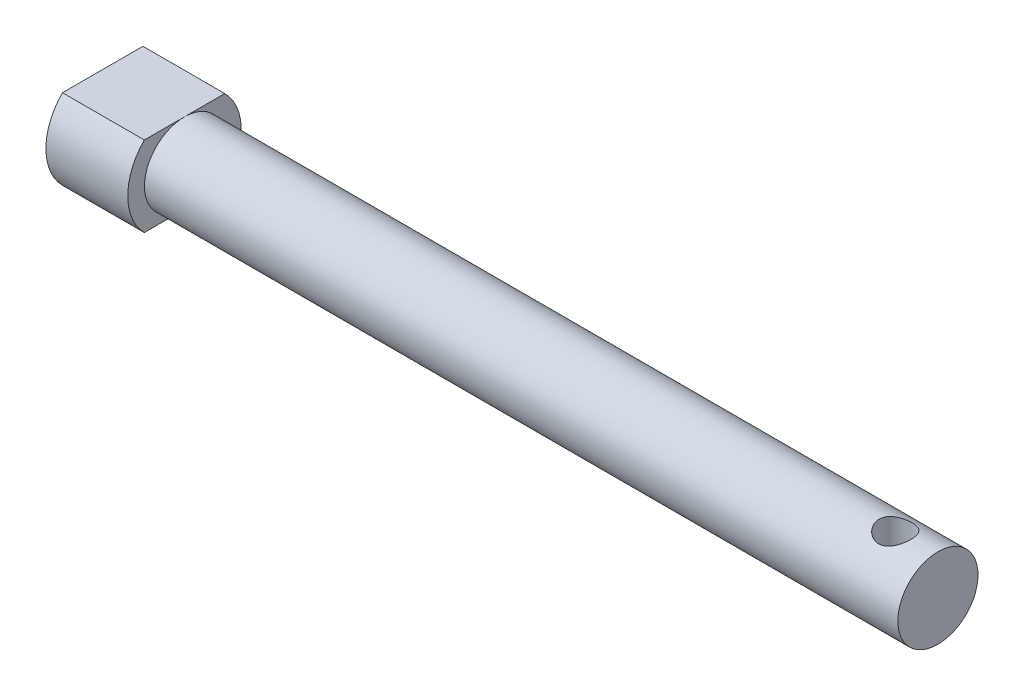
ISO-10303-21;
HEADER;
FILE_DESCRIPTION(('STEP AP214'),'2;1');
FILE_NAME('part.step','',(''),(''),'','','');
FILE_SCHEMA(('AUTOMOTIVE_DESIGN { 1 0 10303 214 1 1 1 1 }'));
ENDSEC;
DATA;
#1=APPLICATION_CONTEXT('core data for automotive mechanical design processes');
#2=APPLICATION_PROTOCOL_DEFINITION('international standard','automotive_design',2000,#1);
#3=PRODUCT_CONTEXT('',#1,'mechanical');
#4=PRODUCT('Part','Part','',(#3));
#5=PRODUCT_RELATED_PRODUCT_CATEGORY('part','',(#4));
#6=PRODUCT_DEFINITION_FORMATION('','',#4);
#7=PRODUCT_DEFINITION_CONTEXT('part definition',#1,'design');
#8=PRODUCT_DEFINITION('design','',#6,#7);
#9=PRODUCT_DEFINITION_SHAPE('','',#8);
#10=(LENGTH_UNIT() NAMED_UNIT(*) SI_UNIT(.MILLI.,.METRE.));
#11=(NAMED_UNIT(*) PLANE_ANGLE_UNIT() SI_UNIT($,.RADIAN.));
#12=(NAMED_UNIT(*) SI_UNIT($,.STERADIAN.) SOLID_ANGLE_UNIT());
#13=UNCERTAINTY_MEASURE_WITH_UNIT(LENGTH_MEASURE(1.E-05),#10,'distance_accuracy_value','');
#14=(GEOMETRIC_REPRESENTATION_CONTEXT(3) GLOBAL_UNCERTAINTY_ASSIGNED_CONTEXT((#13)) GLOBAL_UNIT_ASSIGNED_CONTEXT((#10,
#11,#12)) REPRESENTATION_CONTEXT('',''));
#15=CARTESIAN_POINT('',(0.,0.,0.));
#16=DIRECTION('',(0.,0.,1.));
#17=DIRECTION('',(1.,0.,0.));
#18=AXIS2_PLACEMENT_3D('',#15,#16,#17);
#19=CARTESIAN_POINT('',(25.,0.,0.));
#20=DIRECTION('',(-1.,0.,0.));
#21=DIRECTION('',(0.,0.,1.));
#22=AXIS2_PLACEMENT_3D('',#19,#20,#21);
#23=CYLINDRICAL_SURFACE('',#22,2.4);
#24=CARTESIAN_POINT('',(22.55,2.13307290077015,1.1));
#25=CARTESIAN_POINT('',(22.4973611081542,2.13307906742956,1.0999939328162));
#26=CARTESIAN_POINT('',(22.4446327975776,2.13524724251786,1.09581537649799));
#27=CARTESIAN_POINT('',(22.3407239597943,2.14365008243596,1.07927948296696));
#28=CARTESIAN_POINT('',(22.2895481672871,2.14989608897144,1.06689933317801));
#29=CARTESIAN_POINT('',(22.1904582159836,2.16563423361136,1.03457587900994));
#30=CARTESIAN_POINT('',(22.1425300037906,2.17511115003898,1.01466799265654));
#31=CARTESIAN_POINT('',(22.0507295581409,2.1962868401096,0.967976609276169));
#32=CARTESIAN_POINT('',(22.0068564321033,2.20798512305905,0.941194630258112));
#33=CARTESIAN_POINT('',(21.9211222849345,2.23334152629688,0.879415715364733));
#34=CARTESIAN_POINT('',(21.8795957451861,2.24707857585225,0.843987011030266));
#35=CARTESIAN_POINT('',(21.8028235517017,2.27455826200032,0.766851375117863));
#36=CARTESIAN_POINT('',(21.767580957401,2.28830089806722,0.725141403538048));
#37=CARTESIAN_POINT('',(21.70220125569,2.31541047009048,0.633479084620091));
#38=CARTESIAN_POINT('',(21.6725236507046,2.32869963830472,0.58317364924949));
#39=CARTESIAN_POINT('',(21.6222068512608,2.35261129562496,0.477641105787621));
#40=CARTESIAN_POINT('',(21.6015641774462,2.36323481060152,0.422415902179575));
#41=CARTESIAN_POINT('',(21.5709747671704,2.38035043240875,0.311346063643463));
#42=CARTESIAN_POINT('',(21.5605656093708,2.38701514754088,0.255656085177394));
#43=CARTESIAN_POINT('',(21.549324856314,2.39640138483369,0.142999510461193));
#44=CARTESIAN_POINT('',(21.5484882857825,2.39912495472945,0.0860335927979068));
#45=CARTESIAN_POINT('',(21.5562113671414,2.40046442294417,-0.0231216409185724));
#46=CARTESIAN_POINT('',(21.5640921844718,2.39936461444224,-0.0753570775239067));
#47=CARTESIAN_POINT('',(21.5879164380917,2.39395611770608,-0.177776008278701));
#48=CARTESIAN_POINT('',(21.6038599809259,2.38964738706726,-0.227959475302976));
#49=CARTESIAN_POINT('',(21.6432695754514,2.37840171681631,-0.324948964868288));
#50=CARTESIAN_POINT('',(21.6667359345588,2.37146466979723,-0.371754849290331));
#51=CARTESIAN_POINT('',(21.7204966789125,2.35575905046772,-0.460925101526949));
#52=CARTESIAN_POINT('',(21.7507931029417,2.34698993133886,-0.503288137602053));
#53=CARTESIAN_POINT('',(21.8195443902385,2.32796993020943,-0.585177238951835));
#54=CARTESIAN_POINT('',(21.8583900632552,2.31766075850173,-0.624361900304632));
#55=CARTESIAN_POINT('',(21.9420202339738,2.2972088064946,-0.695857361994229));
#56=CARTESIAN_POINT('',(21.9868068445226,2.28706608684134,-0.728165706127452));
#57=CARTESIAN_POINT('',(22.0831056763412,2.26780044352582,-0.786163316608232));
#58=CARTESIAN_POINT('',(22.1348081956902,2.25873059413291,-0.811556047657341));
#59=CARTESIAN_POINT('',(22.2421593016957,2.24334322193062,-0.853175569499846));
#60=CARTESIAN_POINT('',(22.2978058813868,2.23702431081224,-0.869406984940142));
#61=CARTESIAN_POINT('',(22.408682702335,2.22830957814681,-0.89150000726717));
#62=CARTESIAN_POINT('',(22.4638089749778,2.22574290655263,-0.897814264530672));
#63=CARTESIAN_POINT('',(22.5743849701251,2.22436247380749,-0.901230510564537));
#64=CARTESIAN_POINT('',(22.6298345882284,2.22554756173807,-0.898335324492917));
#65=CARTESIAN_POINT('',(22.7363489739482,2.23132687093266,-0.883874240941882));
#66=CARTESIAN_POINT('',(22.7874894540144,2.23573493299733,-0.872781474695769));
#67=CARTESIAN_POINT('',(22.887152282497,2.24717490771103,-0.842887305451859));
#68=CARTESIAN_POINT('',(22.9356740778623,2.25420737215596,-0.824084281245122));
#69=CARTESIAN_POINT('',(23.0305469517725,2.27032677761784,-0.778598215514448));
#70=CARTESIAN_POINT('',(23.0767708827,2.27947464412103,-0.751672325609347));
#71=CARTESIAN_POINT('',(23.164243316562,2.29861966860239,-0.690913014195771));
#72=CARTESIAN_POINT('',(23.2054899328908,2.30861714618615,-0.657076986464709));
#73=CARTESIAN_POINT('',(23.2845917759763,2.32900067905208,-0.580867510205292));
#74=CARTESIAN_POINT('',(23.3220587175092,2.33937041788318,-0.538085151876284));
#75=CARTESIAN_POINT('',(23.3893452347941,2.35855248535297,-0.446557115893864));
#76=CARTESIAN_POINT('',(23.4191650626518,2.3673648653308,-0.397811634907576));
#77=CARTESIAN_POINT('',(23.4699906110515,2.38222541231385,-0.296012851056268));
#78=CARTESIAN_POINT('',(23.4910650838091,2.38829517554384,-0.242997220710753));
#79=CARTESIAN_POINT('',(23.5239270606385,2.39688527708697,-0.133895395866685));
#80=CARTESIAN_POINT('',(23.5357196100443,2.39940754428439,-0.0778108872618394));
#81=CARTESIAN_POINT('',(23.549104143054,2.40037396052816,0.0318670955152565));
#82=CARTESIAN_POINT('',(23.5513123558277,2.39907383589794,0.0853838521203222));
#83=CARTESIAN_POINT('',(23.547194889212,2.39291197651022,0.191874103386284));
#84=CARTESIAN_POINT('',(23.5408700285691,2.38805058347601,0.244847649676699));
#85=CARTESIAN_POINT('',(23.5202525169446,2.3752497838713,0.347580223332054));
#86=CARTESIAN_POINT('',(23.5061387331075,2.3673806519249,0.397384385846545));
#87=CARTESIAN_POINT('',(23.4706198530052,2.34915802283027,0.4938299154724));
#88=CARTESIAN_POINT('',(23.4492130843792,2.33880395602051,0.540470554209221));
#89=CARTESIAN_POINT('',(23.3983526585985,2.31575614642506,0.632166283652874));
#90=CARTESIAN_POINT('',(23.3685108603735,2.30296288550046,0.676980668214599));
#91=CARTESIAN_POINT('',(23.302188029797,2.27654067293713,0.761124738666118));
#92=CARTESIAN_POINT('',(23.265704050125,2.26291135210265,0.800451976017577));
#93=CARTESIAN_POINT('',(23.1840132129683,2.23501818022079,0.875447087089281));
#94=CARTESIAN_POINT('',(23.1383677985527,2.22077916089791,0.910648572977793));
#95=CARTESIAN_POINT('',(23.0412661917743,2.19421615670551,0.972916229820275));
#96=CARTESIAN_POINT('',(22.9898070978567,2.18189313544867,0.999978313577709));
#97=CARTESIAN_POINT('',(22.883230424813,2.16088948174157,1.04458501148177));
#98=CARTESIAN_POINT('',(22.8281865569538,2.15215250626611,1.06227822630659));
#99=CARTESIAN_POINT('',(22.71546584836,2.13932255971477,1.08789425144292));
#100=CARTESIAN_POINT('',(22.6577993556071,2.13521274791839,1.09585250170122));
#101=CARTESIAN_POINT('',(22.5833000030658,2.13328542286212,1.0995861591471));
#102=CARTESIAN_POINT('',(22.5666544770893,2.13307094969398,1.10000191960298));
#103=CARTESIAN_POINT('',(22.55,2.13307290077015,1.1));
#104=B_SPLINE_CURVE_WITH_KNOTS('',3,(#24,#25,#26,#27,#28,#29,#30,#31,#32,#33,#34,#35,#36,#37,
#38,#39,#40,#41,#42,#43,#44,#45,#46,#47,#48,#49,#50,#51,#52,#53,#54,#55,#56,#57,#58,#59,#60,#61,
#62,#63,#64,#65,#66,#67,#68,#69,#70,#71,#72,#73,#74,#75,#76,#77,#78,#79,#80,#81,#82,#83,#84,#85,
#86,#87,#88,#89,#90,#91,#92,#93,#94,#95,#96,#97,#98,#99,#100,#101,#102,#103),.UNSPECIFIED.,.T.,
.F.,(4,2,2,2,2,2,2,2,2,2,2,2,2,2,2,2,2,2,2,2,2,2,2,2,2,2,2,2,2,2,2,2,2,2,2,2,2,2,2,4),(0.,
0.157869104510436,0.316179172996984,0.473753477652681,0.631293014999153,0.799441977680217,
0.967672584047119,1.14646607267386,1.32519064713431,1.49540657942962,1.6655340393593,
1.82329046845569,1.98104898227579,2.13881394364032,2.29662606054454,2.46427448835348,
2.63198269963741,2.80603344041099,2.97999624132839,3.14576066508831,3.31147424261297,
3.46830440352326,3.62516755748549,3.78728490431094,3.94946350849404,4.12206432385825,
4.29465944828485,4.46587075117827,4.63698892510723,4.79692484805356,4.95684542627888,
5.11323777382421,5.26966600800328,5.43498329920153,5.60037412586418,5.77765607544761,
5.95502689901022,6.12949309948273,6.30332225062417,6.35327063084235),.UNSPECIFIED.);
#105=CARTESIAN_POINT('',(22.55,2.13307290077015,1.1));
#106=VERTEX_POINT('',#105);
#107=EDGE_CURVE('E41',#106,#106,#104,.T.);
#108=ORIENTED_EDGE('',*,*,#107,.T.);
#109=EDGE_LOOP('',(#108));
#110=FACE_BOUND('',#109,.T.);
#111=CARTESIAN_POINT('',(21.5550125628934,-2.4,0.));
#112=CARTESIAN_POINT('',(21.5496974800274,-2.39999569804389,0.0529425259667533));
#113=CARTESIAN_POINT('',(21.5486128021127,-2.39822816233619,0.106390009477298));
#114=CARTESIAN_POINT('',(21.5549316438037,-2.39115881388499,0.212627950102524));
#115=CARTESIAN_POINT('',(21.562356044126,-2.3858483203446,0.265416468227451));
#116=CARTESIAN_POINT('',(21.5853038440982,-2.3720951767978,0.368597497843321));
#117=CARTESIAN_POINT('',(21.600802292909,-2.36366219914388,0.418996871856474));
#118=CARTESIAN_POINT('',(21.6392714286819,-2.34433138032263,0.516308668360662));
#119=CARTESIAN_POINT('',(21.6622399527948,-2.33343425289117,0.563222095331718));
#120=CARTESIAN_POINT('',(21.7160904886893,-2.30952131854956,0.654549466685829));
#121=CARTESIAN_POINT('',(21.7472710226083,-2.29643441583934,0.698768407047663));
#122=CARTESIAN_POINT('',(21.8162253508586,-2.26960601199557,0.7815271091903));
#123=CARTESIAN_POINT('',(21.8540031400232,-2.25586411793219,0.820063403733166));
#124=CARTESIAN_POINT('',(21.93820360084,-2.22800111348079,0.893108947720343));
#125=CARTESIAN_POINT('',(21.9850437763653,-2.21391964761464,0.927154489497616));
#126=CARTESIAN_POINT('',(22.0843583970891,-2.18795761834367,0.986866549171384));
#127=CARTESIAN_POINT('',(22.1368317412667,-2.17607662608198,1.01253470050727));
#128=CARTESIAN_POINT('',(22.2445869115371,-2.15633329209444,1.05391744485951));
#129=CARTESIAN_POINT('',(22.2997506133969,-2.14836871052155,1.0698881565395));
#130=CARTESIAN_POINT('',(22.4124412490498,-2.13713927860724,1.09215283782124));
#131=CARTESIAN_POINT('',(22.4699657062601,-2.13386962638131,1.09845669494732));
#132=CARTESIAN_POINT('',(22.5792924355966,-2.13260372429351,1.10090824065433));
#133=CARTESIAN_POINT('',(22.6310694113897,-2.13409571923493,1.09804145780892));
#134=CARTESIAN_POINT('',(22.7332951012732,-2.14105436610606,1.08440940019957));
#135=CARTESIAN_POINT('',(22.7837436932753,-2.14652138205765,1.07364340204561));
#136=CARTESIAN_POINT('',(22.8810300973231,-2.16062712990782,1.04495800731632));
#137=CARTESIAN_POINT('',(22.927917587299,-2.16920503367838,1.02717526063003));
#138=CARTESIAN_POINT('',(23.0181333635436,-2.18865085860167,0.985060317307436));
#139=CARTESIAN_POINT('',(23.0614604701014,-2.19951953456909,0.960725961165837));
#140=CARTESIAN_POINT('',(23.1476644564978,-2.22364989181094,0.903564653594588));
#141=CARTESIAN_POINT('',(23.1901196901317,-2.23704033491013,0.870156025311646));
#142=CARTESIAN_POINT('',(23.269081376733,-2.26413302659586,0.797008744577358));
#143=CARTESIAN_POINT('',(23.3055847747464,-2.27783543121953,0.757266861961596));
#144=CARTESIAN_POINT('',(23.3742808767427,-2.30533084943626,0.669126102203923));
#145=CARTESIAN_POINT('',(23.4059644650497,-2.31905747551664,0.620307076082446));
#146=CARTESIAN_POINT('',(23.4605700674532,-2.34415476231149,0.517432625147293));
#147=CARTESIAN_POINT('',(23.4834945510773,-2.35552608666126,0.463378681652977));
#148=CARTESIAN_POINT('',(23.5189833780136,-2.37444818230659,0.35353486437855));
#149=CARTESIAN_POINT('',(23.531891889784,-2.38212207109484,0.297878129052698));
#150=CARTESIAN_POINT('',(23.5480314073336,-2.39354827605952,0.184794371954068));
#151=CARTESIAN_POINT('',(23.5512679761894,-2.39730284572813,0.127368387024957));
#152=CARTESIAN_POINT('',(23.5479655544935,-2.40052459277589,0.0170969889341838));
#153=CARTESIAN_POINT('',(23.5421553835185,-2.40029775517561,-0.0357627982431015));
#154=CARTESIAN_POINT('',(23.5222714469845,-2.39649149816038,-0.139773122328005));
#155=CARTESIAN_POINT('',(23.5081979689085,-2.39291219537622,-0.190923718633496));
#156=CARTESIAN_POINT('',(23.472474525128,-2.38297791160866,-0.28956967274061));
#157=CARTESIAN_POINT('',(23.4509080826971,-2.37665334559645,-0.337098558928608));
#158=CARTESIAN_POINT('',(23.4008302403677,-2.36197790019458,-0.427998766973065));
#159=CARTESIAN_POINT('',(23.3723170219734,-2.35362649022907,-0.471368996045478));
#160=CARTESIAN_POINT('',(23.3072254652978,-2.33526187793159,-0.555437694180424));
#161=CARTESIAN_POINT('',(23.2702728817212,-2.32518003916652,-0.595831416710561));
#162=CARTESIAN_POINT('',(23.1902963439072,-2.30488551760114,-0.67006468590944));
#163=CARTESIAN_POINT('',(23.1472699510679,-2.29467278375192,-0.703901587038819));
#164=CARTESIAN_POINT('',(23.053991829791,-2.27485383065271,-0.765597944701423));
#165=CARTESIAN_POINT('',(23.0034984429212,-2.26529728095782,-0.793109900972709));
#166=CARTESIAN_POINT('',(22.8982028161419,-2.24864109308228,-0.839176947154155));
#167=CARTESIAN_POINT('',(22.8434023404268,-2.24154045532408,-0.857735682320428));
#168=CARTESIAN_POINT('',(22.7332158936787,-2.23105523207025,-0.884644281150268));
#169=CARTESIAN_POINT('',(22.6779308166716,-2.22754001580007,-0.893354380436047));
#170=CARTESIAN_POINT('',(22.5665817012624,-2.22429025323019,-0.901417820672914));
#171=CARTESIAN_POINT('',(22.5105179851024,-2.22455418690983,-0.900774923512732));
#172=CARTESIAN_POINT('',(22.4027842395513,-2.2286866172735,-0.890494726525893));
#173=CARTESIAN_POINT('',(22.3510526079754,-2.23233759513042,-0.881400140959037));
#174=CARTESIAN_POINT('',(22.2499031056937,-2.24245183882901,-0.855338044945117));
#175=CARTESIAN_POINT('',(22.2004856845957,-2.24891564866143,-0.838369011568367));
#176=CARTESIAN_POINT('',(22.104067767797,-2.2640366428719,-0.796642223211279));
#177=CARTESIAN_POINT('',(22.057147637869,-2.27274030130489,-0.771716352113727));
#178=CARTESIAN_POINT('',(21.9679799208291,-2.29124855524274,-0.714892445402546));
#179=CARTESIAN_POINT('',(21.9257335880264,-2.30105344486972,-0.682992544968111));
#180=CARTESIAN_POINT('',(21.8441490442164,-2.32135285560915,-0.610593787152216));
#181=CARTESIAN_POINT('',(21.8051937379878,-2.33184968297854,-0.569662799067172));
#182=CARTESIAN_POINT('',(21.7345779913033,-2.35161292864844,-0.48161164820141));
#183=CARTESIAN_POINT('',(21.7029220920254,-2.36087857948688,-0.434487661035162));
#184=CARTESIAN_POINT('',(21.6477786736254,-2.37703787501423,-0.335023691084191));
#185=CARTESIAN_POINT('',(21.624327335056,-2.38392101188822,-0.282661882483391));
#186=CARTESIAN_POINT('',(21.5867181158545,-2.39425968288849,-0.174491685489168));
#187=CARTESIAN_POINT('',(21.5725315257272,-2.39772582274163,-0.118694536291066));
#188=CARTESIAN_POINT('',(21.5598414638591,-2.39973126242434,-0.0415186885305491));
#189=CARTESIAN_POINT('',(21.5571005768997,-2.40000169001026,-0.0207983089892846));
#190=CARTESIAN_POINT('',(21.5550125628934,-2.4,0.));
#191=B_SPLINE_CURVE_WITH_KNOTS('',3,(#111,#112,#113,#114,#115,#116,#117,#118,#119,#120,#121,
#122,#123,#124,#125,#126,#127,#128,#129,#130,#131,#132,#133,#134,#135,#136,#137,#138,#139,#140,
#141,#142,#143,#144,#145,#146,#147,#148,#149,#150,#151,#152,#153,#154,#155,#156,#157,#158,#159,
#160,#161,#162,#163,#164,#165,#166,#167,#168,#169,#170,#171,#172,#173,#174,#175,#176,#177,#178,
#179,#180,#181,#182,#183,#184,#185,#186,#187,#188,#189,#190),.UNSPECIFIED.,.T.,.F.,(4,2,2,2,2,2,
2,2,2,2,2,2,2,2,2,2,2,2,2,2,2,2,2,2,2,2,2,2,2,2,2,2,2,2,2,2,2,2,2,4),(0.,0.159564863902349,
0.31952212936855,0.478987993391657,0.638407727486984,0.804701606014101,0.971096531790586,
1.14901486740354,1.32689849140983,1.49985265365396,1.67262979535882,1.82748753367316,
1.98235945523518,2.13435338189861,2.28639746942571,2.45267142602693,2.61903046075068,
2.79753212428725,2.97598342415412,3.14799175449839,3.31990113059213,3.47866072697354,
3.63741480038462,3.79445320819497,3.95153276906509,4.11780198725526,4.28413815252278,
4.45814295522003,4.63207685287653,4.79941910348179,4.96669404886358,5.12391893220525,
5.28117423574963,5.44200049193113,5.60286980496759,5.77448761382251,5.94621190487067,
6.11868419492535,6.2906194614209,6.35330402893395),.UNSPECIFIED.);
#192=CARTESIAN_POINT('',(21.5550125628934,-2.4,0.));
#193=VERTEX_POINT('',#192);
#194=EDGE_CURVE('E11',#193,#193,#191,.T.);
#195=ORIENTED_EDGE('',*,*,#194,.T.);
#196=EDGE_LOOP('',(#195));
#197=FACE_BOUND('',#196,.T.);
#198=CARTESIAN_POINT('',(25.,0.,0.));
#199=DIRECTION('',(1.,0.,0.));
#200=DIRECTION('',(0.,0.,-1.));
#201=AXIS2_PLACEMENT_3D('',#198,#199,#200);
#202=CIRCLE('',#201,2.4);
#203=CARTESIAN_POINT('',(25.,0.,-2.4));
#204=VERTEX_POINT('',#203);
#205=EDGE_CURVE('E51',#204,#204,#202,.T.);
#206=ORIENTED_EDGE('',*,*,#205,.F.);
#207=EDGE_LOOP('',(#206));
#208=FACE_BOUND('',#207,.T.);
#209=CARTESIAN_POINT('',(-20.1,0.,0.));
#210=DIRECTION('',(-1.,0.,0.));
#211=DIRECTION('',(0.,0.,1.));
#212=AXIS2_PLACEMENT_3D('',#209,#210,#211);
#213=CIRCLE('',#212,2.4);
#214=CARTESIAN_POINT('',(-20.1,2.4,0.));
#215=VERTEX_POINT('',#214);
#216=CARTESIAN_POINT('',(-20.1,-2.4,0.));
#217=VERTEX_POINT('',#216);
#218=EDGE_CURVE('E80',#215,#217,#213,.T.);
#219=ORIENTED_EDGE('',*,*,#218,.F.);
#220=CARTESIAN_POINT('',(-20.1,0.,0.));
#221=DIRECTION('',(-1.,0.,0.));
#222=DIRECTION('',(0.,0.,1.));
#223=AXIS2_PLACEMENT_3D('',#220,#221,#222);
#224=CIRCLE('',#223,2.4);
#225=EDGE_CURVE('E125',#217,#215,#224,.T.);
#226=ORIENTED_EDGE('',*,*,#225,.F.);
#227=EDGE_LOOP('',(#219,#226));
#228=FACE_BOUND('',#227,.T.);
#229=ADVANCED_FACE('F37',(#110,#197,#208,#228),#23,.T.);
#230=CARTESIAN_POINT('',(25.,0.,0.));
#231=DIRECTION('',(1.,0.,0.));
#232=DIRECTION('',(0.,0.,-1.));
#233=AXIS2_PLACEMENT_3D('',#230,#231,#232);
#234=PLANE('',#233);
#235=ORIENTED_EDGE('',*,*,#205,.T.);
#236=EDGE_LOOP('',(#235));
#237=FACE_BOUND('',#236,.T.);
#238=ADVANCED_FACE('F164',(#237),#234,.T.);
#239=CARTESIAN_POINT('',(-25.,0.,0.));
#240=DIRECTION('',(1.,0.,0.));
#241=DIRECTION('',(0.,0.,-1.));
#242=AXIS2_PLACEMENT_3D('',#239,#240,#241);
#243=PLANE('',#242);
#244=DIRECTION('',(0.,0.,1.));
#245=VECTOR('',#244,1.);
#246=CARTESIAN_POINT('',(-25.,2.4,0.));
#247=LINE('',#246,#245);
#248=CARTESIAN_POINT('',(-25.,2.4,-2.40831891575846));
#249=VERTEX_POINT('',#248);
#250=CARTESIAN_POINT('',(-25.,2.4,2.40831891575846));
#251=VERTEX_POINT('',#250);
#252=EDGE_CURVE('E121',#249,#251,#247,.T.);
#253=ORIENTED_EDGE('',*,*,#252,.F.);
#254=CARTESIAN_POINT('',(-25.,0.,0.));
#255=DIRECTION('',(-1.,0.,0.));
#256=DIRECTION('',(0.,0.,1.));
#257=AXIS2_PLACEMENT_3D('',#254,#255,#256);
#258=CIRCLE('',#257,3.4);
#259=CARTESIAN_POINT('',(-25.,-2.4,-2.40831891575846));
#260=VERTEX_POINT('',#259);
#261=EDGE_CURVE('E103',#249,#260,#258,.T.);
#262=ORIENTED_EDGE('',*,*,#261,.T.);
#263=DIRECTION('',(0.,0.,1.));
#264=VECTOR('',#263,1.);
#265=CARTESIAN_POINT('',(-25.,-2.4,0.));
#266=LINE('',#265,#264);
#267=CARTESIAN_POINT('',(-25.,-2.4,2.40831891575846));
#268=VERTEX_POINT('',#267);
#269=EDGE_CURVE('E127',#260,#268,#266,.T.);
#270=ORIENTED_EDGE('',*,*,#269,.T.);
#271=CARTESIAN_POINT('',(-25.,0.,0.));
#272=DIRECTION('',(-1.,0.,0.));
#273=DIRECTION('',(0.,0.,1.));
#274=AXIS2_PLACEMENT_3D('',#271,#272,#273);
#275=CIRCLE('',#274,3.4);
#276=EDGE_CURVE('E130',#268,#251,#275,.T.);
#277=ORIENTED_EDGE('',*,*,#276,.T.);
#278=EDGE_LOOP('',(#253,#262,#270,#277));
#279=FACE_BOUND('',#278,.T.);
#280=ADVANCED_FACE('F163',(#279),#243,.F.);
#281=CARTESIAN_POINT('',(-20.1,-2.4,0.));
#282=DIRECTION('',(0.,-1.,0.));
#283=DIRECTION('',(0.,0.,-1.));
#284=AXIS2_PLACEMENT_3D('',#281,#282,#283);
#285=PLANE('',#284);
#286=ORIENTED_EDGE('',*,*,#269,.F.);
#287=DIRECTION('',(-1.,0.,0.));
#288=VECTOR('',#287,1.);
#289=CARTESIAN_POINT('',(-20.1,-2.4,-2.40831891575846));
#290=LINE('',#289,#288);
#291=CARTESIAN_POINT('',(-20.1,-2.4,-2.40831891575846));
#292=VERTEX_POINT('',#291);
#293=EDGE_CURVE('E110',#292,#260,#290,.T.);
#294=ORIENTED_EDGE('',*,*,#293,.F.);
#295=DIRECTION('',(0.,0.,1.));
#296=VECTOR('',#295,1.);
#297=CARTESIAN_POINT('',(-20.1,-2.4,0.));
#298=LINE('',#297,#296);
#299=EDGE_CURVE('E106',#292,#217,#298,.T.);
#300=ORIENTED_EDGE('',*,*,#299,.T.);
#301=DIRECTION('',(0.,0.,1.));
#302=VECTOR('',#301,1.);
#303=CARTESIAN_POINT('',(-20.1,-2.4,0.));
#304=LINE('',#303,#302);
#305=CARTESIAN_POINT('',(-20.1,-2.4,2.40831891575846));
#306=VERTEX_POINT('',#305);
#307=EDGE_CURVE('E118',#217,#306,#304,.T.);
#308=ORIENTED_EDGE('',*,*,#307,.T.);
#309=DIRECTION('',(-1.,0.,0.));
#310=VECTOR('',#309,1.);
#311=CARTESIAN_POINT('',(-20.1,-2.4,2.40831891575846));
#312=LINE('',#311,#310);
#313=EDGE_CURVE('E70',#306,#268,#312,.T.);
#314=ORIENTED_EDGE('',*,*,#313,.T.);
#315=EDGE_LOOP('',(#286,#294,#300,#308,#314));
#316=FACE_BOUND('',#315,.T.);
#317=ADVANCED_FACE('F157',(#316),#285,.T.);
#318=CARTESIAN_POINT('',(-20.1,2.4,0.));
#319=DIRECTION('',(0.,-1.,0.));
#320=DIRECTION('',(0.,0.,-1.));
#321=AXIS2_PLACEMENT_3D('',#318,#319,#320);
#322=PLANE('',#321);
#323=ORIENTED_EDGE('',*,*,#252,.T.);
#324=DIRECTION('',(-1.,0.,0.));
#325=VECTOR('',#324,1.);
#326=CARTESIAN_POINT('',(-20.1,2.4,2.40831891575846));
#327=LINE('',#326,#325);
#328=CARTESIAN_POINT('',(-20.1,2.4,2.40831891575846));
#329=VERTEX_POINT('',#328);
#330=EDGE_CURVE('E134',#329,#251,#327,.T.);
#331=ORIENTED_EDGE('',*,*,#330,.F.);
#332=DIRECTION('',(0.,0.,1.));
#333=VECTOR('',#332,1.);
#334=CARTESIAN_POINT('',(-20.1,2.4,0.));
#335=LINE('',#334,#333);
#336=EDGE_CURVE('E59',#215,#329,#335,.T.);
#337=ORIENTED_EDGE('',*,*,#336,.F.);
#338=DIRECTION('',(0.,0.,1.));
#339=VECTOR('',#338,1.);
#340=CARTESIAN_POINT('',(-20.1,2.4,0.));
#341=LINE('',#340,#339);
#342=CARTESIAN_POINT('',(-20.1,2.4,-2.40831891575846));
#343=VERTEX_POINT('',#342);
#344=EDGE_CURVE('E108',#343,#215,#341,.T.);
#345=ORIENTED_EDGE('',*,*,#344,.F.);
#346=DIRECTION('',(-1.,0.,0.));
#347=VECTOR('',#346,1.);
#348=CARTESIAN_POINT('',(-20.1,2.4,-2.40831891575846));
#349=LINE('',#348,#347);
#350=EDGE_CURVE('E95',#343,#249,#349,.T.);
#351=ORIENTED_EDGE('',*,*,#350,.T.);
#352=EDGE_LOOP('',(#323,#331,#337,#345,#351));
#353=FACE_BOUND('',#352,.T.);
#354=ADVANCED_FACE('F109',(#353),#322,.F.);
#355=CARTESIAN_POINT('',(-20.1,0.,0.));
#356=DIRECTION('',(-1.,0.,0.));
#357=DIRECTION('',(0.,0.,1.));
#358=AXIS2_PLACEMENT_3D('',#355,#356,#357);
#359=CYLINDRICAL_SURFACE('',#358,3.4);
#360=ORIENTED_EDGE('',*,*,#276,.F.);
#361=ORIENTED_EDGE('',*,*,#313,.F.);
#362=CARTESIAN_POINT('',(-20.1,0.,0.));
#363=DIRECTION('',(-1.,0.,0.));
#364=DIRECTION('',(0.,0.,1.));
#365=AXIS2_PLACEMENT_3D('',#362,#363,#364);
#366=CIRCLE('',#365,3.4);
#367=EDGE_CURVE('E120',#306,#329,#366,.T.);
#368=ORIENTED_EDGE('',*,*,#367,.T.);
#369=ORIENTED_EDGE('',*,*,#330,.T.);
#370=EDGE_LOOP('',(#360,#361,#368,#369));
#371=FACE_BOUND('',#370,.T.);
#372=ADVANCED_FACE('F154',(#371),#359,.T.);
#373=CARTESIAN_POINT('',(-20.1,0.,0.));
#374=DIRECTION('',(-1.,0.,0.));
#375=DIRECTION('',(0.,0.,1.));
#376=AXIS2_PLACEMENT_3D('',#373,#374,#375);
#377=PLANE('',#376);
#378=ORIENTED_EDGE('',*,*,#307,.F.);
#379=ORIENTED_EDGE('',*,*,#225,.T.);
#380=ORIENTED_EDGE('',*,*,#336,.T.);
#381=ORIENTED_EDGE('',*,*,#367,.F.);
#382=EDGE_LOOP('',(#378,#379,#380,#381));
#383=FACE_BOUND('',#382,.T.);
#384=ADVANCED_FACE('F149',(#383),#377,.F.);
#385=CARTESIAN_POINT('',(-20.1,0.,0.));
#386=DIRECTION('',(-1.,0.,0.));
#387=DIRECTION('',(0.,0.,1.));
#388=AXIS2_PLACEMENT_3D('',#385,#386,#387);
#389=CYLINDRICAL_SURFACE('',#388,3.4);
#390=ORIENTED_EDGE('',*,*,#261,.F.);
#391=ORIENTED_EDGE('',*,*,#350,.F.);
#392=CARTESIAN_POINT('',(-20.1,0.,0.));
#393=DIRECTION('',(-1.,0.,0.));
#394=DIRECTION('',(0.,0.,1.));
#395=AXIS2_PLACEMENT_3D('',#392,#393,#394);
#396=CIRCLE('',#395,3.4);
#397=EDGE_CURVE('E100',#343,#292,#396,.T.);
#398=ORIENTED_EDGE('',*,*,#397,.T.);
#399=ORIENTED_EDGE('',*,*,#293,.T.);
#400=EDGE_LOOP('',(#390,#391,#398,#399));
#401=FACE_BOUND('',#400,.T.);
#402=ADVANCED_FACE('F97',(#401),#389,.T.);
#403=CARTESIAN_POINT('',(-20.1,0.,0.));
#404=DIRECTION('',(-1.,0.,0.));
#405=DIRECTION('',(0.,0.,1.));
#406=AXIS2_PLACEMENT_3D('',#403,#404,#405);
#407=PLANE('',#406);
#408=ORIENTED_EDGE('',*,*,#344,.T.);
#409=ORIENTED_EDGE('',*,*,#218,.T.);
#410=ORIENTED_EDGE('',*,*,#299,.F.);
#411=ORIENTED_EDGE('',*,*,#397,.F.);
#412=EDGE_LOOP('',(#408,#409,#410,#411));
#413=FACE_BOUND('',#412,.T.);
#414=ADVANCED_FACE('F112',(#413),#407,.F.);
#415=CARTESIAN_POINT('',(22.55,-2.4,0.0999999999999997));
#416=DIRECTION('',(0.,1.,0.));
#417=DIRECTION('',(0.,0.,1.));
#418=AXIS2_PLACEMENT_3D('',#415,#416,#417);
#419=CYLINDRICAL_SURFACE('',#418,1.);
#420=ORIENTED_EDGE('',*,*,#107,.F.);
#421=EDGE_LOOP('',(#420));
#422=FACE_BOUND('',#421,.T.);
#423=ORIENTED_EDGE('',*,*,#194,.F.);
#424=EDGE_LOOP('',(#423));
#425=FACE_BOUND('',#424,.T.);
#426=ADVANCED_FACE('F141',(#422,#425),#419,.F.);
#427=CLOSED_SHELL('',(#229,#238,#280,#317,#354,#372,#384,#402,#414,#426));
#428=MANIFOLD_SOLID_BREP('B2',#427);
#429=ADVANCED_BREP_SHAPE_REPRESENTATION('',(#18,#428),#14);
#430=SHAPE_DEFINITION_REPRESENTATION(#9,#429);
ENDSEC;
END-ISO-10303-21;
